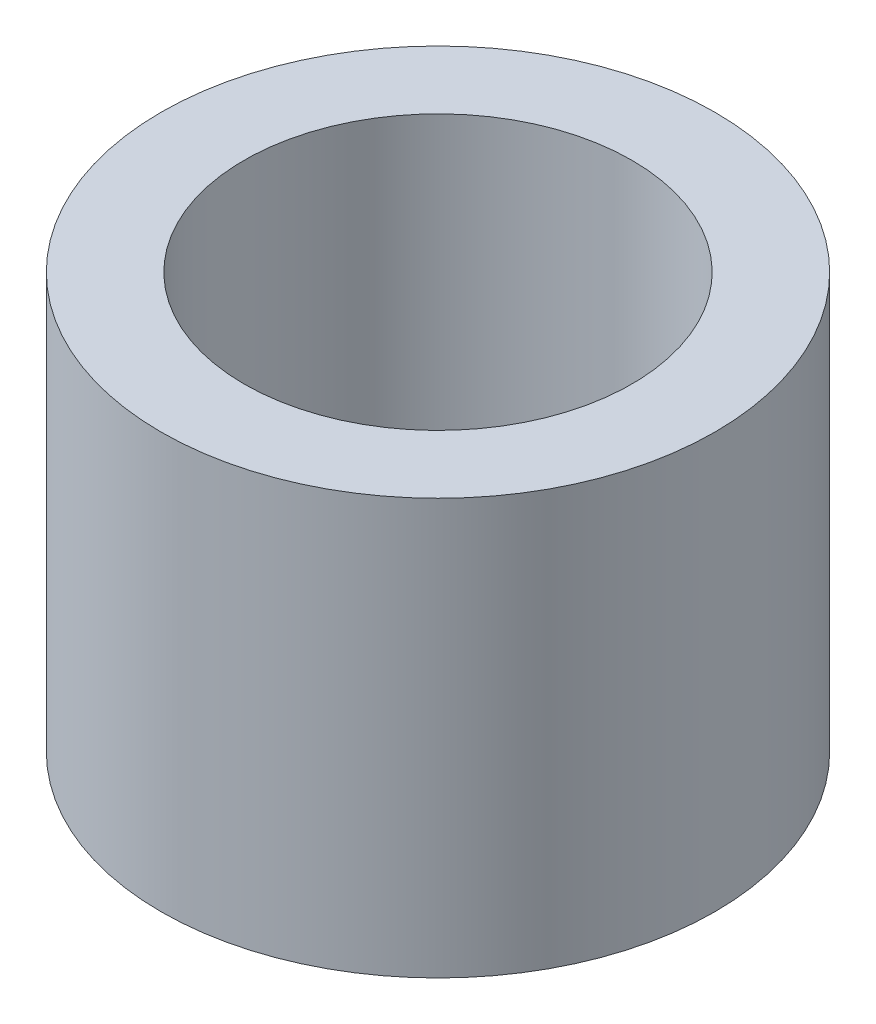
ISO-10303-21;
HEADER;
FILE_DESCRIPTION(('STEP AP214'),'2;1');
FILE_NAME('part.step','',(''),(''),'','','');
FILE_SCHEMA(('AUTOMOTIVE_DESIGN { 1 0 10303 214 1 1 1 1 }'));
ENDSEC;
DATA;
#1=APPLICATION_CONTEXT('core data for automotive mechanical design processes');
#2=APPLICATION_PROTOCOL_DEFINITION('international standard','automotive_design',2000,#1);
#3=PRODUCT_CONTEXT('',#1,'mechanical');
#4=PRODUCT('Part','Part','',(#3));
#5=PRODUCT_RELATED_PRODUCT_CATEGORY('part','',(#4));
#6=PRODUCT_DEFINITION_FORMATION('','',#4);
#7=PRODUCT_DEFINITION_CONTEXT('part definition',#1,'design');
#8=PRODUCT_DEFINITION('design','',#6,#7);
#9=PRODUCT_DEFINITION_SHAPE('','',#8);
#10=(LENGTH_UNIT() NAMED_UNIT(*) SI_UNIT(.MILLI.,.METRE.));
#11=(NAMED_UNIT(*) PLANE_ANGLE_UNIT() SI_UNIT($,.RADIAN.));
#12=(NAMED_UNIT(*) SI_UNIT($,.STERADIAN.) SOLID_ANGLE_UNIT());
#13=UNCERTAINTY_MEASURE_WITH_UNIT(LENGTH_MEASURE(1.E-05),#10,'distance_accuracy_value','');
#14=(GEOMETRIC_REPRESENTATION_CONTEXT(3) GLOBAL_UNCERTAINTY_ASSIGNED_CONTEXT((#13)) GLOBAL_UNIT_ASSIGNED_CONTEXT((#10,
#11,#12)) REPRESENTATION_CONTEXT('',''));
#15=CARTESIAN_POINT('',(0.,0.,0.));
#16=DIRECTION('',(0.,0.,1.));
#17=DIRECTION('',(1.,0.,0.));
#18=AXIS2_PLACEMENT_3D('',#15,#16,#17);
#19=CARTESIAN_POINT('',(0.,7.5,0.));
#20=DIRECTION('',(0.,1.,0.));
#21=DIRECTION('',(0.,0.,1.));
#22=AXIS2_PLACEMENT_3D('',#19,#20,#21);
#23=PLANE('',#22);
#24=CARTESIAN_POINT('',(0.,7.5,0.));
#25=DIRECTION('',(0.,1.,0.));
#26=DIRECTION('',(0.,0.,1.));
#27=AXIS2_PLACEMENT_3D('',#24,#25,#26);
#28=CIRCLE('',#27,5.);
#29=CARTESIAN_POINT('',(0.,7.5,5.));
#30=VERTEX_POINT('',#29);
#31=EDGE_CURVE('E10',#30,#30,#28,.T.);
#32=ORIENTED_EDGE('',*,*,#31,.T.);
#33=EDGE_LOOP('',(#32));
#34=FACE_BOUND('',#33,.T.);
#35=CARTESIAN_POINT('',(0.,7.5,0.));
#36=DIRECTION('',(0.,1.,0.));
#37=DIRECTION('',(0.,0.,1.));
#38=AXIS2_PLACEMENT_3D('',#35,#36,#37);
#39=CIRCLE('',#38,3.5);
#40=CARTESIAN_POINT('',(0.,7.5,3.5));
#41=VERTEX_POINT('',#40);
#42=EDGE_CURVE('E42',#41,#41,#39,.T.);
#43=ORIENTED_EDGE('',*,*,#42,.F.);
#44=EDGE_LOOP('',(#43));
#45=FACE_BOUND('',#44,.T.);
#46=ADVANCED_FACE('F31',(#34,#45),#23,.T.);
#47=CARTESIAN_POINT('',(0.,0.,0.));
#48=DIRECTION('',(0.,1.,0.));
#49=DIRECTION('',(0.,0.,1.));
#50=AXIS2_PLACEMENT_3D('',#47,#48,#49);
#51=PLANE('',#50);
#52=CARTESIAN_POINT('',(0.,0.,0.));
#53=DIRECTION('',(0.,1.,0.));
#54=DIRECTION('',(0.,0.,1.));
#55=AXIS2_PLACEMENT_3D('',#52,#53,#54);
#56=CIRCLE('',#55,5.);
#57=CARTESIAN_POINT('',(0.,0.,5.));
#58=VERTEX_POINT('',#57);
#59=EDGE_CURVE('E35',#58,#58,#56,.T.);
#60=ORIENTED_EDGE('',*,*,#59,.F.);
#61=EDGE_LOOP('',(#60));
#62=FACE_BOUND('',#61,.T.);
#63=CARTESIAN_POINT('',(0.,0.,0.));
#64=DIRECTION('',(0.,1.,0.));
#65=DIRECTION('',(0.,0.,1.));
#66=AXIS2_PLACEMENT_3D('',#63,#64,#65);
#67=CIRCLE('',#66,3.5);
#68=CARTESIAN_POINT('',(0.,0.,3.5));
#69=VERTEX_POINT('',#68);
#70=EDGE_CURVE('E44',#69,#69,#67,.T.);
#71=ORIENTED_EDGE('',*,*,#70,.T.);
#72=EDGE_LOOP('',(#71));
#73=FACE_BOUND('',#72,.T.);
#74=ADVANCED_FACE('F54',(#62,#73),#51,.F.);
#75=CARTESIAN_POINT('',(0.,7.5,0.));
#76=DIRECTION('',(0.,-1.,0.));
#77=DIRECTION('',(0.,0.,-1.));
#78=AXIS2_PLACEMENT_3D('',#75,#76,#77);
#79=CYLINDRICAL_SURFACE('',#78,5.);
#80=ORIENTED_EDGE('',*,*,#31,.F.);
#81=EDGE_LOOP('',(#80));
#82=FACE_BOUND('',#81,.T.);
#83=ORIENTED_EDGE('',*,*,#59,.T.);
#84=EDGE_LOOP('',(#83));
#85=FACE_BOUND('',#84,.T.);
#86=ADVANCED_FACE('F33',(#82,#85),#79,.T.);
#87=CARTESIAN_POINT('',(0.,7.5,0.));
#88=DIRECTION('',(0.,-1.,0.));
#89=DIRECTION('',(0.,0.,-1.));
#90=AXIS2_PLACEMENT_3D('',#87,#88,#89);
#91=CYLINDRICAL_SURFACE('',#90,3.5);
#92=ORIENTED_EDGE('',*,*,#42,.T.);
#93=EDGE_LOOP('',(#92));
#94=FACE_BOUND('',#93,.T.);
#95=ORIENTED_EDGE('',*,*,#70,.F.);
#96=EDGE_LOOP('',(#95));
#97=FACE_BOUND('',#96,.T.);
#98=ADVANCED_FACE('F50',(#94,#97),#91,.F.);
#99=CLOSED_SHELL('',(#46,#74,#86,#98));
#100=MANIFOLD_SOLID_BREP('B2',#99);
#101=ADVANCED_BREP_SHAPE_REPRESENTATION('',(#18,#100),#14);
#102=SHAPE_DEFINITION_REPRESENTATION(#9,#101);
ENDSEC;
END-ISO-10303-21;
